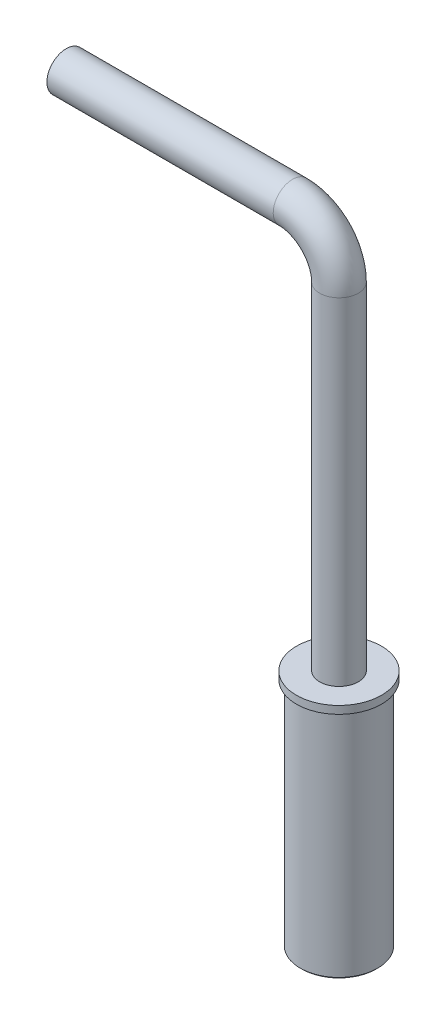
ISO-10303-21;
HEADER;
FILE_DESCRIPTION(('STEP AP214'),'2;1');
FILE_NAME('part.step','',(''),(''),'','','');
FILE_SCHEMA(('AUTOMOTIVE_DESIGN { 1 0 10303 214 1 1 1 1 }'));
ENDSEC;
DATA;
#1=APPLICATION_CONTEXT('core data for automotive mechanical design processes');
#2=APPLICATION_PROTOCOL_DEFINITION('international standard','automotive_design',2000,#1);
#3=PRODUCT_CONTEXT('',#1,'mechanical');
#4=PRODUCT('Part','Part','',(#3));
#5=PRODUCT_RELATED_PRODUCT_CATEGORY('part','',(#4));
#6=PRODUCT_DEFINITION_FORMATION('','',#4);
#7=PRODUCT_DEFINITION_CONTEXT('part definition',#1,'design');
#8=PRODUCT_DEFINITION('design','',#6,#7);
#9=PRODUCT_DEFINITION_SHAPE('','',#8);
#10=(LENGTH_UNIT() NAMED_UNIT(*) SI_UNIT(.MILLI.,.METRE.));
#11=(NAMED_UNIT(*) PLANE_ANGLE_UNIT() SI_UNIT($,.RADIAN.));
#12=(NAMED_UNIT(*) SI_UNIT($,.STERADIAN.) SOLID_ANGLE_UNIT());
#13=UNCERTAINTY_MEASURE_WITH_UNIT(LENGTH_MEASURE(1.E-05),#10,'distance_accuracy_value','');
#14=(GEOMETRIC_REPRESENTATION_CONTEXT(3) GLOBAL_UNCERTAINTY_ASSIGNED_CONTEXT((#13)) GLOBAL_UNIT_ASSIGNED_CONTEXT((#10,
#11,#12)) REPRESENTATION_CONTEXT('',''));
#15=CARTESIAN_POINT('',(0.,0.,0.));
#16=DIRECTION('',(0.,0.,1.));
#17=DIRECTION('',(1.,0.,0.));
#18=AXIS2_PLACEMENT_3D('',#15,#16,#17);
#19=CARTESIAN_POINT('',(0.,0.,0.));
#20=DIRECTION('',(0.,-1.,0.));
#21=DIRECTION('',(0.,0.,-1.));
#22=AXIS2_PLACEMENT_3D('',#19,#20,#21);
#23=CYLINDRICAL_SURFACE('',#22,2.5);
#24=CARTESIAN_POINT('',(0.,31.,0.));
#25=DIRECTION('',(0.,-1.,0.));
#26=DIRECTION('',(0.,0.,-1.));
#27=AXIS2_PLACEMENT_3D('',#24,#25,#26);
#28=CIRCLE('',#27,2.5);
#29=CARTESIAN_POINT('',(0.,31.,-2.5));
#30=VERTEX_POINT('',#29);
#31=EDGE_CURVE('E47',#30,#30,#28,.T.);
#32=ORIENTED_EDGE('',*,*,#31,.F.);
#33=EDGE_LOOP('',(#32));
#34=FACE_BOUND('',#33,.T.);
#35=CARTESIAN_POINT('',(0.,74.5,0.));
#36=DIRECTION('',(0.,-1.,0.));
#37=DIRECTION('',(0.,0.,-1.));
#38=AXIS2_PLACEMENT_3D('',#35,#36,#37);
#39=CIRCLE('',#38,2.5);
#40=CARTESIAN_POINT('',(2.5,74.5,0.));
#41=VERTEX_POINT('',#40);
#42=EDGE_CURVE('E44',#41,#41,#39,.T.);
#43=ORIENTED_EDGE('',*,*,#42,.T.);
#44=EDGE_LOOP('',(#43));
#45=FACE_BOUND('',#44,.T.);
#46=ADVANCED_FACE('F15',(#34,#45),#23,.T.);
#47=CARTESIAN_POINT('',(2.5,31.,0.));
#48=DIRECTION('',(0.,-1.,0.));
#49=DIRECTION('',(0.,0.,-1.));
#50=AXIS2_PLACEMENT_3D('',#47,#48,#49);
#51=PLANE('',#50);
#52=CARTESIAN_POINT('',(0.,31.,0.));
#53=DIRECTION('',(0.,-1.,0.));
#54=DIRECTION('',(0.,0.,-1.));
#55=AXIS2_PLACEMENT_3D('',#52,#53,#54);
#56=CIRCLE('',#55,5.5);
#57=CARTESIAN_POINT('',(0.,31.,-5.5));
#58=VERTEX_POINT('',#57);
#59=EDGE_CURVE('E41',#58,#58,#56,.T.);
#60=ORIENTED_EDGE('',*,*,#59,.F.);
#61=EDGE_LOOP('',(#60));
#62=FACE_BOUND('',#61,.T.);
#63=ORIENTED_EDGE('',*,*,#31,.T.);
#64=EDGE_LOOP('',(#63));
#65=FACE_BOUND('',#64,.T.);
#66=ADVANCED_FACE('F51',(#62,#65),#51,.F.);
#67=CARTESIAN_POINT('',(-6.,74.5,0.));
#68=DIRECTION('',(0.,0.,1.));
#69=DIRECTION('',(1.,0.,0.));
#70=AXIS2_PLACEMENT_3D('',#67,#68,#69);
#71=TOROIDAL_SURFACE('',#70,6.,2.5);
#72=CARTESIAN_POINT('',(-6.,80.5,0.));
#73=DIRECTION('',(-1.,0.,0.));
#74=DIRECTION('',(0.,1.,0.));
#75=AXIS2_PLACEMENT_3D('',#72,#73,#74);
#76=CIRCLE('',#75,2.5);
#77=CARTESIAN_POINT('',(-6.,83.,0.));
#78=VERTEX_POINT('',#77);
#79=EDGE_CURVE('E38',#78,#78,#76,.T.);
#80=CARTESIAN_POINT('',(-6.,74.5,0.));
#81=DIRECTION('',(0.,0.,1.));
#82=DIRECTION('',(1.,0.,0.));
#83=AXIS2_PLACEMENT_3D('',#80,#81,#82);
#84=CIRCLE('',#83,8.5);
#85=EDGE_CURVE('',#41,#78,#84,.T.);
#86=ORIENTED_EDGE('',*,*,#42,.F.);
#87=ORIENTED_EDGE('',*,*,#79,.F.);
#88=ORIENTED_EDGE('',*,*,#85,.T.);
#89=ORIENTED_EDGE('',*,*,#85,.F.);
#90=EDGE_LOOP('',(#86,#88,#87,#89));
#91=FACE_BOUND('',#90,.T.);
#92=ADVANCED_FACE('F58',(#91),#71,.T.);
#93=CARTESIAN_POINT('',(0.,0.,0.));
#94=DIRECTION('',(0.,-1.,0.));
#95=DIRECTION('',(0.,0.,-1.));
#96=AXIS2_PLACEMENT_3D('',#93,#94,#95);
#97=CYLINDRICAL_SURFACE('',#96,5.5);
#98=CARTESIAN_POINT('',(0.,30.,0.));
#99=DIRECTION('',(0.,-1.,0.));
#100=DIRECTION('',(0.,0.,-1.));
#101=AXIS2_PLACEMENT_3D('',#98,#99,#100);
#102=CIRCLE('',#101,5.5);
#103=CARTESIAN_POINT('',(0.,30.,-5.5));
#104=VERTEX_POINT('',#103);
#105=EDGE_CURVE('E35',#104,#104,#102,.T.);
#106=ORIENTED_EDGE('',*,*,#105,.F.);
#107=EDGE_LOOP('',(#106));
#108=FACE_BOUND('',#107,.T.);
#109=ORIENTED_EDGE('',*,*,#59,.T.);
#110=EDGE_LOOP('',(#109));
#111=FACE_BOUND('',#110,.T.);
#112=ADVANCED_FACE('F61',(#108,#111),#97,.T.);
#113=CARTESIAN_POINT('',(-35.25,80.5,0.));
#114=DIRECTION('',(1.,0.,0.));
#115=DIRECTION('',(0.,0.,-1.));
#116=AXIS2_PLACEMENT_3D('',#113,#114,#115);
#117=CYLINDRICAL_SURFACE('',#116,2.5);
#118=CARTESIAN_POINT('',(-35.25,80.5,0.));
#119=DIRECTION('',(-1.,0.,0.));
#120=DIRECTION('',(0.,1.,0.));
#121=AXIS2_PLACEMENT_3D('',#118,#119,#120);
#122=CIRCLE('',#121,2.5);
#123=CARTESIAN_POINT('',(-35.25,83.,0.));
#124=VERTEX_POINT('',#123);
#125=EDGE_CURVE('E30',#124,#124,#122,.T.);
#126=ORIENTED_EDGE('',*,*,#125,.F.);
#127=EDGE_LOOP('',(#126));
#128=FACE_BOUND('',#127,.T.);
#129=ORIENTED_EDGE('',*,*,#79,.T.);
#130=EDGE_LOOP('',(#129));
#131=FACE_BOUND('',#130,.T.);
#132=ADVANCED_FACE('F65',(#128,#131),#117,.T.);
#133=CARTESIAN_POINT('',(5.5,30.,0.));
#134=DIRECTION('',(0.,1.,0.));
#135=DIRECTION('',(0.,0.,1.));
#136=AXIS2_PLACEMENT_3D('',#133,#134,#135);
#137=PLANE('',#136);
#138=CARTESIAN_POINT('',(0.,30.,0.));
#139=DIRECTION('',(0.,-1.,0.));
#140=DIRECTION('',(0.,0.,-1.));
#141=AXIS2_PLACEMENT_3D('',#138,#139,#140);
#142=CIRCLE('',#141,5.);
#143=CARTESIAN_POINT('',(0.,30.,-5.));
#144=VERTEX_POINT('',#143);
#145=EDGE_CURVE('E26',#144,#144,#142,.T.);
#146=ORIENTED_EDGE('',*,*,#145,.F.);
#147=EDGE_LOOP('',(#146));
#148=FACE_BOUND('',#147,.T.);
#149=ORIENTED_EDGE('',*,*,#105,.T.);
#150=EDGE_LOOP('',(#149));
#151=FACE_BOUND('',#150,.T.);
#152=ADVANCED_FACE('F67',(#148,#151),#137,.F.);
#153=CARTESIAN_POINT('',(-35.25,80.5,0.));
#154=DIRECTION('',(-1.,0.,0.));
#155=DIRECTION('',(0.,0.,1.));
#156=AXIS2_PLACEMENT_3D('',#153,#154,#155);
#157=PLANE('',#156);
#158=ORIENTED_EDGE('',*,*,#125,.T.);
#159=EDGE_LOOP('',(#158));
#160=FACE_BOUND('',#159,.T.);
#161=ADVANCED_FACE('F75',(#160),#157,.T.);
#162=CARTESIAN_POINT('',(0.,0.,0.));
#163=DIRECTION('',(0.,-1.,0.));
#164=DIRECTION('',(0.,0.,-1.));
#165=AXIS2_PLACEMENT_3D('',#162,#163,#164);
#166=CYLINDRICAL_SURFACE('',#165,5.);
#167=CARTESIAN_POINT('',(0.,0.2,0.));
#168=DIRECTION('',(0.,-1.,0.));
#169=DIRECTION('',(0.,0.,-1.));
#170=AXIS2_PLACEMENT_3D('',#167,#168,#169);
#171=CIRCLE('',#170,5.);
#172=CARTESIAN_POINT('',(0.,0.2,-5.));
#173=VERTEX_POINT('',#172);
#174=EDGE_CURVE('E22',#173,#173,#171,.T.);
#175=ORIENTED_EDGE('',*,*,#174,.F.);
#176=EDGE_LOOP('',(#175));
#177=FACE_BOUND('',#176,.T.);
#178=ORIENTED_EDGE('',*,*,#145,.T.);
#179=EDGE_LOOP('',(#178));
#180=FACE_BOUND('',#179,.T.);
#181=ADVANCED_FACE('F84',(#177,#180),#166,.T.);
#182=CARTESIAN_POINT('',(0.,0.2,0.));
#183=DIRECTION('',(0.,1.,0.));
#184=DIRECTION('',(0.,0.,1.));
#185=AXIS2_PLACEMENT_3D('',#182,#183,#184);
#186=CONICAL_SURFACE('',#185,5.,0.785398163397452);
#187=CARTESIAN_POINT('',(0.,0.,0.));
#188=DIRECTION('',(0.,-1.,0.));
#189=DIRECTION('',(0.,0.,-1.));
#190=AXIS2_PLACEMENT_3D('',#187,#188,#189);
#191=CIRCLE('',#190,4.8);
#192=CARTESIAN_POINT('',(0.,0.,-4.8));
#193=VERTEX_POINT('',#192);
#194=EDGE_CURVE('E10',#193,#193,#191,.T.);
#195=ORIENTED_EDGE('',*,*,#194,.F.);
#196=EDGE_LOOP('',(#195));
#197=FACE_BOUND('',#196,.T.);
#198=ORIENTED_EDGE('',*,*,#174,.T.);
#199=EDGE_LOOP('',(#198));
#200=FACE_BOUND('',#199,.T.);
#201=ADVANCED_FACE('F87',(#197,#200),#186,.T.);
#202=CARTESIAN_POINT('',(4.8,0.,0.));
#203=DIRECTION('',(0.,1.,0.));
#204=DIRECTION('',(0.,0.,1.));
#205=AXIS2_PLACEMENT_3D('',#202,#203,#204);
#206=PLANE('',#205);
#207=ORIENTED_EDGE('',*,*,#194,.T.);
#208=EDGE_LOOP('',(#207));
#209=FACE_BOUND('',#208,.T.);
#210=ADVANCED_FACE('F17',(#209),#206,.F.);
#211=CLOSED_SHELL('',(#46,#66,#92,#112,#132,#152,#161,#181,#201,#210));
#212=MANIFOLD_SOLID_BREP('B1',#211);
#213=ADVANCED_BREP_SHAPE_REPRESENTATION('',(#18,#212),#14);
#214=SHAPE_DEFINITION_REPRESENTATION(#9,#213);
ENDSEC;
END-ISO-10303-21;
